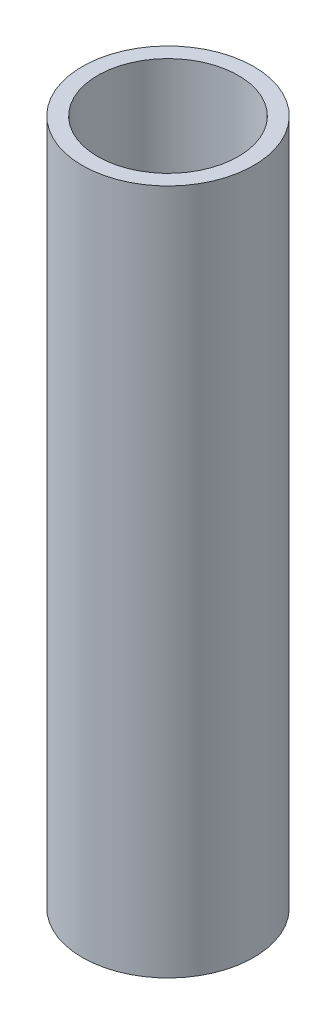
ISO-10303-21;
HEADER;
FILE_DESCRIPTION(('STEP AP214'),'2;1');
FILE_NAME('part.step','',(''),(''),'','','');
FILE_SCHEMA(('AUTOMOTIVE_DESIGN { 1 0 10303 214 1 1 1 1 }'));
ENDSEC;
DATA;
#1=APPLICATION_CONTEXT('core data for automotive mechanical design processes');
#2=APPLICATION_PROTOCOL_DEFINITION('international standard','automotive_design',2000,#1);
#3=PRODUCT_CONTEXT('',#1,'mechanical');
#4=PRODUCT('Part','Part','',(#3));
#5=PRODUCT_RELATED_PRODUCT_CATEGORY('part','',(#4));
#6=PRODUCT_DEFINITION_FORMATION('','',#4);
#7=PRODUCT_DEFINITION_CONTEXT('part definition',#1,'design');
#8=PRODUCT_DEFINITION('design','',#6,#7);
#9=PRODUCT_DEFINITION_SHAPE('','',#8);
#10=(LENGTH_UNIT() NAMED_UNIT(*) SI_UNIT(.MILLI.,.METRE.));
#11=(NAMED_UNIT(*) PLANE_ANGLE_UNIT() SI_UNIT($,.RADIAN.));
#12=(NAMED_UNIT(*) SI_UNIT($,.STERADIAN.) SOLID_ANGLE_UNIT());
#13=UNCERTAINTY_MEASURE_WITH_UNIT(LENGTH_MEASURE(1.E-05),#10,'distance_accuracy_value','');
#14=(GEOMETRIC_REPRESENTATION_CONTEXT(3) GLOBAL_UNCERTAINTY_ASSIGNED_CONTEXT((#13)) GLOBAL_UNIT_ASSIGNED_CONTEXT((#10,
#11,#12)) REPRESENTATION_CONTEXT('',''));
#15=CARTESIAN_POINT('',(0.,0.,0.));
#16=DIRECTION('',(0.,0.,1.));
#17=DIRECTION('',(1.,0.,0.));
#18=AXIS2_PLACEMENT_3D('',#15,#16,#17);
#19=CARTESIAN_POINT('',(0.,101.6,0.));
#20=DIRECTION('',(0.,1.,0.));
#21=DIRECTION('',(0.,0.,1.));
#22=AXIS2_PLACEMENT_3D('',#19,#20,#21);
#23=PLANE('',#22);
#24=CARTESIAN_POINT('',(0.,101.6,0.));
#25=DIRECTION('',(0.,1.,0.));
#26=DIRECTION('',(0.,0.,1.));
#27=AXIS2_PLACEMENT_3D('',#24,#25,#26);
#28=CIRCLE('',#27,12.7);
#29=CARTESIAN_POINT('',(0.,101.6,12.7));
#30=VERTEX_POINT('',#29);
#31=EDGE_CURVE('E10',#30,#30,#28,.T.);
#32=ORIENTED_EDGE('',*,*,#31,.T.);
#33=EDGE_LOOP('',(#32));
#34=FACE_BOUND('',#33,.T.);
#35=CARTESIAN_POINT('',(0.,101.6,0.));
#36=DIRECTION('',(0.,1.,0.));
#37=DIRECTION('',(0.,0.,1.));
#38=AXIS2_PLACEMENT_3D('',#35,#36,#37);
#39=CIRCLE('',#38,10.414);
#40=CARTESIAN_POINT('',(0.,101.6,10.414));
#41=VERTEX_POINT('',#40);
#42=EDGE_CURVE('E42',#41,#41,#39,.T.);
#43=ORIENTED_EDGE('',*,*,#42,.F.);
#44=EDGE_LOOP('',(#43));
#45=FACE_BOUND('',#44,.T.);
#46=ADVANCED_FACE('F31',(#34,#45),#23,.T.);
#47=CARTESIAN_POINT('',(0.,0.,0.));
#48=DIRECTION('',(0.,1.,0.));
#49=DIRECTION('',(0.,0.,1.));
#50=AXIS2_PLACEMENT_3D('',#47,#48,#49);
#51=PLANE('',#50);
#52=CARTESIAN_POINT('',(0.,0.,0.));
#53=DIRECTION('',(0.,1.,0.));
#54=DIRECTION('',(0.,0.,1.));
#55=AXIS2_PLACEMENT_3D('',#52,#53,#54);
#56=CIRCLE('',#55,12.7);
#57=CARTESIAN_POINT('',(0.,0.,12.7));
#58=VERTEX_POINT('',#57);
#59=EDGE_CURVE('E35',#58,#58,#56,.T.);
#60=ORIENTED_EDGE('',*,*,#59,.F.);
#61=EDGE_LOOP('',(#60));
#62=FACE_BOUND('',#61,.T.);
#63=CARTESIAN_POINT('',(0.,0.,0.));
#64=DIRECTION('',(0.,1.,0.));
#65=DIRECTION('',(0.,0.,1.));
#66=AXIS2_PLACEMENT_3D('',#63,#64,#65);
#67=CIRCLE('',#66,10.414);
#68=CARTESIAN_POINT('',(0.,0.,10.414));
#69=VERTEX_POINT('',#68);
#70=EDGE_CURVE('E44',#69,#69,#67,.T.);
#71=ORIENTED_EDGE('',*,*,#70,.T.);
#72=EDGE_LOOP('',(#71));
#73=FACE_BOUND('',#72,.T.);
#74=ADVANCED_FACE('F54',(#62,#73),#51,.F.);
#75=CARTESIAN_POINT('',(0.,101.6,0.));
#76=DIRECTION('',(0.,-1.,0.));
#77=DIRECTION('',(0.,0.,-1.));
#78=AXIS2_PLACEMENT_3D('',#75,#76,#77);
#79=CYLINDRICAL_SURFACE('',#78,12.7);
#80=ORIENTED_EDGE('',*,*,#31,.F.);
#81=EDGE_LOOP('',(#80));
#82=FACE_BOUND('',#81,.T.);
#83=ORIENTED_EDGE('',*,*,#59,.T.);
#84=EDGE_LOOP('',(#83));
#85=FACE_BOUND('',#84,.T.);
#86=ADVANCED_FACE('F33',(#82,#85),#79,.T.);
#87=CARTESIAN_POINT('',(0.,101.6,0.));
#88=DIRECTION('',(0.,-1.,0.));
#89=DIRECTION('',(0.,0.,-1.));
#90=AXIS2_PLACEMENT_3D('',#87,#88,#89);
#91=CYLINDRICAL_SURFACE('',#90,10.414);
#92=ORIENTED_EDGE('',*,*,#42,.T.);
#93=EDGE_LOOP('',(#92));
#94=FACE_BOUND('',#93,.T.);
#95=ORIENTED_EDGE('',*,*,#70,.F.);
#96=EDGE_LOOP('',(#95));
#97=FACE_BOUND('',#96,.T.);
#98=ADVANCED_FACE('F50',(#94,#97),#91,.F.);
#99=CLOSED_SHELL('',(#46,#74,#86,#98));
#100=MANIFOLD_SOLID_BREP('B2',#99);
#101=ADVANCED_BREP_SHAPE_REPRESENTATION('',(#18,#100),#14);
#102=SHAPE_DEFINITION_REPRESENTATION(#9,#101);
ENDSEC;
END-ISO-10303-21;
